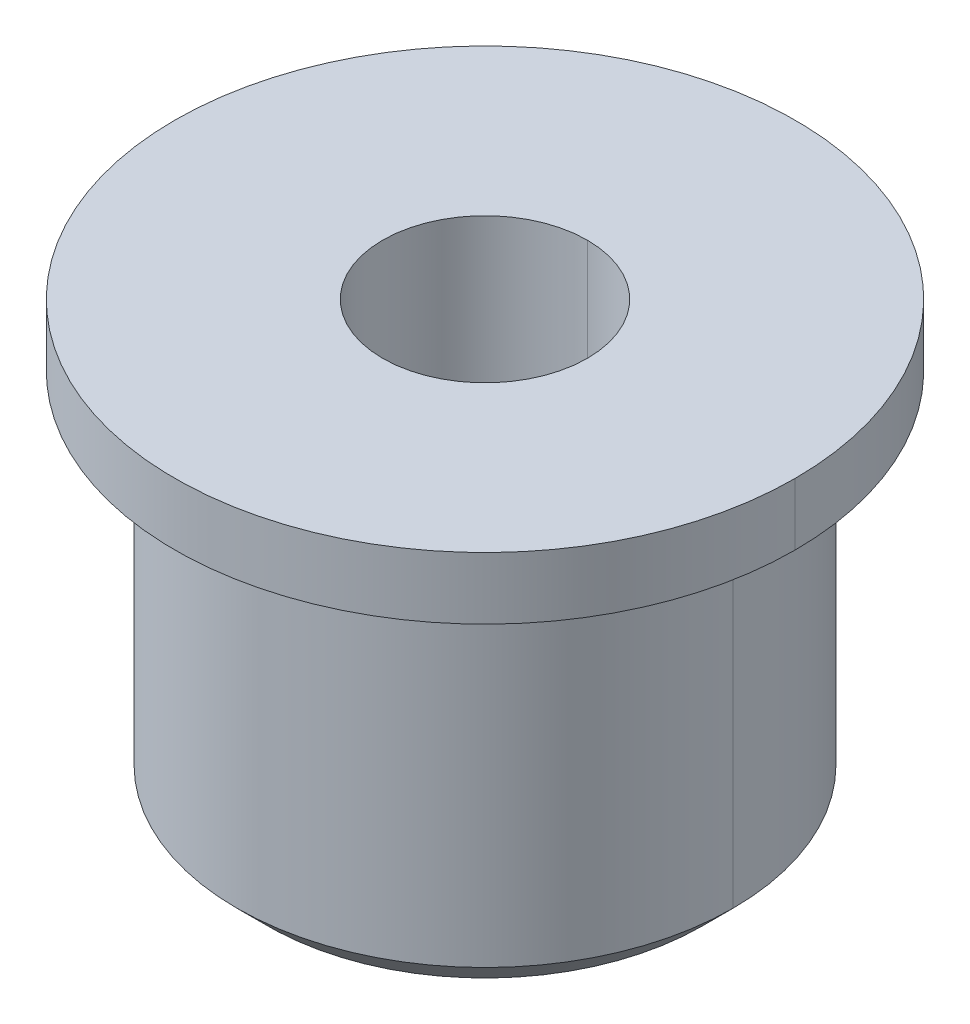
ISO-10303-21;
HEADER;
FILE_DESCRIPTION(('STEP AP214'),'2;1');
FILE_NAME('part.step','',(''),(''),'','','');
FILE_SCHEMA(('AUTOMOTIVE_DESIGN { 1 0 10303 214 1 1 1 1 }'));
ENDSEC;
DATA;
#1=APPLICATION_CONTEXT('core data for automotive mechanical design processes');
#2=APPLICATION_PROTOCOL_DEFINITION('international standard','automotive_design',2000,#1);
#3=PRODUCT_CONTEXT('',#1,'mechanical');
#4=PRODUCT('Part','Part','',(#3));
#5=PRODUCT_RELATED_PRODUCT_CATEGORY('part','',(#4));
#6=PRODUCT_DEFINITION_FORMATION('','',#4);
#7=PRODUCT_DEFINITION_CONTEXT('part definition',#1,'design');
#8=PRODUCT_DEFINITION('design','',#6,#7);
#9=PRODUCT_DEFINITION_SHAPE('','',#8);
#10=(LENGTH_UNIT() NAMED_UNIT(*) SI_UNIT(.MILLI.,.METRE.));
#11=(NAMED_UNIT(*) PLANE_ANGLE_UNIT() SI_UNIT($,.RADIAN.));
#12=(NAMED_UNIT(*) SI_UNIT($,.STERADIAN.) SOLID_ANGLE_UNIT());
#13=UNCERTAINTY_MEASURE_WITH_UNIT(LENGTH_MEASURE(1.E-05),#10,'distance_accuracy_value','');
#14=(GEOMETRIC_REPRESENTATION_CONTEXT(3) GLOBAL_UNCERTAINTY_ASSIGNED_CONTEXT((#13)) GLOBAL_UNIT_ASSIGNED_CONTEXT((#10,
#11,#12)) REPRESENTATION_CONTEXT('',''));
#15=CARTESIAN_POINT('',(0.,0.,0.));
#16=DIRECTION('',(0.,0.,1.));
#17=DIRECTION('',(1.,0.,0.));
#18=AXIS2_PLACEMENT_3D('',#15,#16,#17);
#19=CARTESIAN_POINT('',(0.,7.,0.));
#20=DIRECTION('',(0.,1.,0.));
#21=DIRECTION('',(0.,0.,1.));
#22=AXIS2_PLACEMENT_3D('',#19,#20,#21);
#23=CYLINDRICAL_SURFACE('',#22,1.65);
#24=CARTESIAN_POINT('',(0.,2.,0.));
#25=DIRECTION('',(0.,1.,0.));
#26=DIRECTION('',(0.,0.,1.));
#27=AXIS2_PLACEMENT_3D('',#24,#25,#26);
#28=CIRCLE('',#27,1.65);
#29=CARTESIAN_POINT('',(0.,2.,-1.65));
#30=VERTEX_POINT('',#29);
#31=CARTESIAN_POINT('',(0.,2.,1.65));
#32=VERTEX_POINT('',#31);
#33=EDGE_CURVE('E41',#30,#32,#28,.T.);
#34=ORIENTED_EDGE('',*,*,#33,.F.);
#35=DIRECTION('',(0.,1.,0.));
#36=VECTOR('',#35,1.);
#37=CARTESIAN_POINT('',(0.,7.,-1.65));
#38=LINE('',#37,#36);
#39=CARTESIAN_POINT('',(0.,7.,-1.65));
#40=VERTEX_POINT('',#39);
#41=EDGE_CURVE('E11',#30,#40,#38,.T.);
#42=ORIENTED_EDGE('',*,*,#41,.T.);
#43=CARTESIAN_POINT('',(0.,7.,0.));
#44=DIRECTION('',(0.,1.,0.));
#45=DIRECTION('',(0.,0.,1.));
#46=AXIS2_PLACEMENT_3D('',#43,#44,#45);
#47=CIRCLE('',#46,1.65);
#48=CARTESIAN_POINT('',(0.,7.,1.65));
#49=VERTEX_POINT('',#48);
#50=EDGE_CURVE('E27',#40,#49,#47,.T.);
#51=ORIENTED_EDGE('',*,*,#50,.T.);
#52=DIRECTION('',(0.,1.,0.));
#53=VECTOR('',#52,1.);
#54=CARTESIAN_POINT('',(0.,7.,1.65));
#55=LINE('',#54,#53);
#56=EDGE_CURVE('E79',#32,#49,#55,.T.);
#57=ORIENTED_EDGE('',*,*,#56,.F.);
#58=EDGE_LOOP('',(#34,#42,#51,#57));
#59=FACE_BOUND('',#58,.T.);
#60=ADVANCED_FACE('F16',(#59),#23,.F.);
#61=CARTESIAN_POINT('',(0.,2.,0.));
#62=DIRECTION('',(0.,1.,0.));
#63=DIRECTION('',(0.,0.,1.));
#64=AXIS2_PLACEMENT_3D('',#61,#62,#63);
#65=CONICAL_SURFACE('',#64,1.65,1.02974425867665);
#66=DIRECTION('',(0.,0.515038074910055,0.857167300702112));
#67=VECTOR('',#66,1.);
#68=CARTESIAN_POINT('',(0.,2.,1.65));
#69=LINE('',#68,#67);
#70=CARTESIAN_POINT('',(0.,1.00857997860453,0.));
#71=VERTEX_POINT('',#70);
#72=EDGE_CURVE('E142',#71,#32,#69,.T.);
#73=ORIENTED_EDGE('',*,*,#72,.F.);
#74=DIRECTION('',(0.,0.515038074910055,-0.857167300702112));
#75=VECTOR('',#74,1.);
#76=CARTESIAN_POINT('',(0.,2.,-1.65));
#77=LINE('',#76,#75);
#78=EDGE_CURVE('E145',#71,#30,#77,.T.);
#79=ORIENTED_EDGE('',*,*,#78,.T.);
#80=ORIENTED_EDGE('',*,*,#33,.T.);
#81=EDGE_LOOP('',(#73,#79,#80));
#82=FACE_BOUND('',#81,.T.);
#83=ADVANCED_FACE('F18',(#82),#65,.F.);
#84=CARTESIAN_POINT('',(0.,0.5,0.));
#85=DIRECTION('',(0.,1.,0.));
#86=DIRECTION('',(-1.,0.,0.));
#87=AXIS2_PLACEMENT_3D('',#84,#85,#86);
#88=CONICAL_SURFACE('',#87,4.,0.78539816339745);
#89=CARTESIAN_POINT('',(0.,0.,0.));
#90=DIRECTION('',(0.,-1.,0.));
#91=DIRECTION('',(1.,0.,0.));
#92=AXIS2_PLACEMENT_3D('',#89,#90,#91);
#93=CIRCLE('',#92,3.5);
#94=CARTESIAN_POINT('',(3.5,0.,0.));
#95=VERTEX_POINT('',#94);
#96=CARTESIAN_POINT('',(-3.5,0.,0.));
#97=VERTEX_POINT('',#96);
#98=EDGE_CURVE('E146',#95,#97,#93,.T.);
#99=ORIENTED_EDGE('',*,*,#98,.F.);
#100=DIRECTION('',(0.707106781186549,0.707106781186546,0.));
#101=VECTOR('',#100,1.);
#102=CARTESIAN_POINT('',(4.,0.500000000000006,0.));
#103=LINE('',#102,#101);
#104=CARTESIAN_POINT('',(4.,0.500000000000006,0.));
#105=VERTEX_POINT('',#104);
#106=EDGE_CURVE('E20',#95,#105,#103,.T.);
#107=ORIENTED_EDGE('',*,*,#106,.T.);
#108=CARTESIAN_POINT('',(0.,0.5,0.));
#109=DIRECTION('',(0.,1.,0.));
#110=DIRECTION('',(1.,0.,0.));
#111=AXIS2_PLACEMENT_3D('',#108,#109,#110);
#112=CIRCLE('',#111,4.);
#113=CARTESIAN_POINT('',(-4.,0.5,0.));
#114=VERTEX_POINT('',#113);
#115=EDGE_CURVE('E172',#114,#105,#112,.T.);
#116=ORIENTED_EDGE('',*,*,#115,.F.);
#117=DIRECTION('',(-0.707106781186549,0.707106781186546,0.));
#118=VECTOR('',#117,1.);
#119=CARTESIAN_POINT('',(-4.,0.5,0.));
#120=LINE('',#119,#118);
#121=EDGE_CURVE('E138',#97,#114,#120,.T.);
#122=ORIENTED_EDGE('',*,*,#121,.F.);
#123=EDGE_LOOP('',(#99,#107,#116,#122));
#124=FACE_BOUND('',#123,.T.);
#125=ADVANCED_FACE('F215',(#124),#88,.T.);
#126=CARTESIAN_POINT('',(0.,0.,0.));
#127=DIRECTION('',(0.,1.,0.));
#128=DIRECTION('',(-1.,0.,0.));
#129=AXIS2_PLACEMENT_3D('',#126,#127,#128);
#130=CYLINDRICAL_SURFACE('',#129,4.);
#131=ORIENTED_EDGE('',*,*,#115,.T.);
#132=DIRECTION('',(0.,1.,0.));
#133=VECTOR('',#132,1.);
#134=CARTESIAN_POINT('',(4.,0.,0.));
#135=LINE('',#134,#133);
#136=CARTESIAN_POINT('',(4.,6.,0.));
#137=VERTEX_POINT('',#136);
#138=EDGE_CURVE('E122',#105,#137,#135,.T.);
#139=ORIENTED_EDGE('',*,*,#138,.T.);
#140=CARTESIAN_POINT('',(0.,6.,0.));
#141=DIRECTION('',(0.,1.,0.));
#142=DIRECTION('',(-1.,0.,0.));
#143=AXIS2_PLACEMENT_3D('',#140,#141,#142);
#144=CIRCLE('',#143,4.);
#145=CARTESIAN_POINT('',(-4.,6.,0.));
#146=VERTEX_POINT('',#145);
#147=EDGE_CURVE('E117',#146,#137,#144,.T.);
#148=ORIENTED_EDGE('',*,*,#147,.F.);
#149=DIRECTION('',(0.,1.,0.));
#150=VECTOR('',#149,1.);
#151=CARTESIAN_POINT('',(-4.,0.,0.));
#152=LINE('',#151,#150);
#153=EDGE_CURVE('E141',#114,#146,#152,.T.);
#154=ORIENTED_EDGE('',*,*,#153,.F.);
#155=EDGE_LOOP('',(#131,#139,#148,#154));
#156=FACE_BOUND('',#155,.T.);
#157=ADVANCED_FACE('F209',(#156),#130,.T.);
#158=CARTESIAN_POINT('',(0.,0.,0.));
#159=DIRECTION('',(0.,1.,0.));
#160=DIRECTION('',(-1.,0.,0.));
#161=AXIS2_PLACEMENT_3D('',#158,#159,#160);
#162=CYLINDRICAL_SURFACE('',#161,5.);
#163=CARTESIAN_POINT('',(0.,6.,0.));
#164=DIRECTION('',(0.,1.,0.));
#165=DIRECTION('',(-1.,0.,0.));
#166=AXIS2_PLACEMENT_3D('',#163,#164,#165);
#167=CIRCLE('',#166,5.);
#168=CARTESIAN_POINT('',(-5.,6.,0.));
#169=VERTEX_POINT('',#168);
#170=CARTESIAN_POINT('',(5.,6.,0.));
#171=VERTEX_POINT('',#170);
#172=EDGE_CURVE('E108',#169,#171,#167,.T.);
#173=ORIENTED_EDGE('',*,*,#172,.T.);
#174=DIRECTION('',(0.,1.,0.));
#175=VECTOR('',#174,1.);
#176=CARTESIAN_POINT('',(5.,0.,0.));
#177=LINE('',#176,#175);
#178=CARTESIAN_POINT('',(5.,7.,0.));
#179=VERTEX_POINT('',#178);
#180=EDGE_CURVE('E123',#171,#179,#177,.T.);
#181=ORIENTED_EDGE('',*,*,#180,.T.);
#182=CARTESIAN_POINT('',(0.,7.,0.));
#183=DIRECTION('',(0.,1.,0.));
#184=DIRECTION('',(-1.,0.,0.));
#185=AXIS2_PLACEMENT_3D('',#182,#183,#184);
#186=CIRCLE('',#185,5.);
#187=CARTESIAN_POINT('',(-5.,7.,0.));
#188=VERTEX_POINT('',#187);
#189=EDGE_CURVE('E110',#188,#179,#186,.T.);
#190=ORIENTED_EDGE('',*,*,#189,.F.);
#191=DIRECTION('',(0.,1.,0.));
#192=VECTOR('',#191,1.);
#193=CARTESIAN_POINT('',(-5.,0.,0.));
#194=LINE('',#193,#192);
#195=EDGE_CURVE('E104',#169,#188,#194,.T.);
#196=ORIENTED_EDGE('',*,*,#195,.F.);
#197=EDGE_LOOP('',(#173,#181,#190,#196));
#198=FACE_BOUND('',#197,.T.);
#199=ADVANCED_FACE('F106',(#198),#162,.T.);
#200=CARTESIAN_POINT('',(-4.,0.,0.));
#201=DIRECTION('',(0.,-1.,0.));
#202=DIRECTION('',(0.,0.,-1.));
#203=AXIS2_PLACEMENT_3D('',#200,#201,#202);
#204=PLANE('',#203);
#205=CARTESIAN_POINT('',(0.,0.,0.));
#206=DIRECTION('',(0.,-1.,0.));
#207=DIRECTION('',(1.,0.,0.));
#208=AXIS2_PLACEMENT_3D('',#205,#206,#207);
#209=CIRCLE('',#208,3.5);
#210=EDGE_CURVE('E150',#97,#95,#209,.T.);
#211=ORIENTED_EDGE('',*,*,#210,.T.);
#212=ORIENTED_EDGE('',*,*,#98,.T.);
#213=EDGE_LOOP('',(#211,#212));
#214=FACE_BOUND('',#213,.T.);
#215=ADVANCED_FACE('F222',(#214),#204,.T.);
#216=CARTESIAN_POINT('',(0.,7.,0.));
#217=DIRECTION('',(0.,1.,0.));
#218=DIRECTION('',(1.,0.,0.));
#219=AXIS2_PLACEMENT_3D('',#216,#217,#218);
#220=PLANE('',#219);
#221=ORIENTED_EDGE('',*,*,#189,.T.);
#222=CARTESIAN_POINT('',(0.,7.,0.));
#223=DIRECTION('',(0.,1.,0.));
#224=DIRECTION('',(-1.,0.,0.));
#225=AXIS2_PLACEMENT_3D('',#222,#223,#224);
#226=CIRCLE('',#225,5.);
#227=EDGE_CURVE('E127',#179,#188,#226,.T.);
#228=ORIENTED_EDGE('',*,*,#227,.T.);
#229=EDGE_LOOP('',(#221,#228));
#230=FACE_BOUND('',#229,.T.);
#231=CARTESIAN_POINT('',(0.,7.,0.));
#232=DIRECTION('',(0.,1.,0.));
#233=DIRECTION('',(0.,0.,1.));
#234=AXIS2_PLACEMENT_3D('',#231,#232,#233);
#235=CIRCLE('',#234,1.65);
#236=EDGE_CURVE('E155',#49,#40,#235,.T.);
#237=ORIENTED_EDGE('',*,*,#236,.F.);
#238=ORIENTED_EDGE('',*,*,#50,.F.);
#239=EDGE_LOOP('',(#237,#238));
#240=FACE_BOUND('',#239,.T.);
#241=ADVANCED_FACE('F224',(#230,#240),#220,.T.);
#242=CARTESIAN_POINT('',(0.,0.,0.));
#243=DIRECTION('',(0.,1.,0.));
#244=DIRECTION('',(-1.,0.,0.));
#245=AXIS2_PLACEMENT_3D('',#242,#243,#244);
#246=CYLINDRICAL_SURFACE('',#245,5.);
#247=ORIENTED_EDGE('',*,*,#180,.F.);
#248=CARTESIAN_POINT('',(0.,6.,0.));
#249=DIRECTION('',(0.,1.,0.));
#250=DIRECTION('',(-1.,0.,0.));
#251=AXIS2_PLACEMENT_3D('',#248,#249,#250);
#252=CIRCLE('',#251,5.);
#253=EDGE_CURVE('E116',#171,#169,#252,.T.);
#254=ORIENTED_EDGE('',*,*,#253,.T.);
#255=ORIENTED_EDGE('',*,*,#195,.T.);
#256=ORIENTED_EDGE('',*,*,#227,.F.);
#257=EDGE_LOOP('',(#247,#254,#255,#256));
#258=FACE_BOUND('',#257,.T.);
#259=ADVANCED_FACE('F125',(#258),#246,.T.);
#260=CARTESIAN_POINT('',(-5.,6.,0.));
#261=DIRECTION('',(0.,-1.,0.));
#262=DIRECTION('',(0.,0.,-1.));
#263=AXIS2_PLACEMENT_3D('',#260,#261,#262);
#264=PLANE('',#263);
#265=ORIENTED_EDGE('',*,*,#172,.F.);
#266=ORIENTED_EDGE('',*,*,#253,.F.);
#267=EDGE_LOOP('',(#265,#266));
#268=FACE_BOUND('',#267,.T.);
#269=ORIENTED_EDGE('',*,*,#147,.T.);
#270=CARTESIAN_POINT('',(0.,6.,0.));
#271=DIRECTION('',(0.,1.,0.));
#272=DIRECTION('',(-1.,0.,0.));
#273=AXIS2_PLACEMENT_3D('',#270,#271,#272);
#274=CIRCLE('',#273,4.);
#275=EDGE_CURVE('E136',#137,#146,#274,.T.);
#276=ORIENTED_EDGE('',*,*,#275,.T.);
#277=EDGE_LOOP('',(#269,#276));
#278=FACE_BOUND('',#277,.T.);
#279=ADVANCED_FACE('F119',(#268,#278),#264,.T.);
#280=CARTESIAN_POINT('',(0.,0.,0.));
#281=DIRECTION('',(0.,1.,0.));
#282=DIRECTION('',(-1.,0.,0.));
#283=AXIS2_PLACEMENT_3D('',#280,#281,#282);
#284=CYLINDRICAL_SURFACE('',#283,4.);
#285=ORIENTED_EDGE('',*,*,#138,.F.);
#286=CARTESIAN_POINT('',(0.,0.5,0.));
#287=DIRECTION('',(0.,1.,0.));
#288=DIRECTION('',(1.,0.,0.));
#289=AXIS2_PLACEMENT_3D('',#286,#287,#288);
#290=CIRCLE('',#289,4.);
#291=EDGE_CURVE('E154',#105,#114,#290,.T.);
#292=ORIENTED_EDGE('',*,*,#291,.T.);
#293=ORIENTED_EDGE('',*,*,#153,.T.);
#294=ORIENTED_EDGE('',*,*,#275,.F.);
#295=EDGE_LOOP('',(#285,#292,#293,#294));
#296=FACE_BOUND('',#295,.T.);
#297=ADVANCED_FACE('F213',(#296),#284,.T.);
#298=CARTESIAN_POINT('',(0.,0.5,0.));
#299=DIRECTION('',(0.,1.,0.));
#300=DIRECTION('',(-1.,0.,0.));
#301=AXIS2_PLACEMENT_3D('',#298,#299,#300);
#302=CONICAL_SURFACE('',#301,4.,0.78539816339745);
#303=ORIENTED_EDGE('',*,*,#106,.F.);
#304=ORIENTED_EDGE('',*,*,#210,.F.);
#305=ORIENTED_EDGE('',*,*,#121,.T.);
#306=ORIENTED_EDGE('',*,*,#291,.F.);
#307=EDGE_LOOP('',(#303,#304,#305,#306));
#308=FACE_BOUND('',#307,.T.);
#309=ADVANCED_FACE('F220',(#308),#302,.T.);
#310=CARTESIAN_POINT('',(0.,2.,0.));
#311=DIRECTION('',(0.,1.,0.));
#312=DIRECTION('',(0.,0.,1.));
#313=AXIS2_PLACEMENT_3D('',#310,#311,#312);
#314=CONICAL_SURFACE('',#313,1.65,1.02974425867665);
#315=ORIENTED_EDGE('',*,*,#78,.F.);
#316=ORIENTED_EDGE('',*,*,#72,.T.);
#317=CARTESIAN_POINT('',(0.,2.,0.));
#318=DIRECTION('',(0.,1.,0.));
#319=DIRECTION('',(0.,0.,1.));
#320=AXIS2_PLACEMENT_3D('',#317,#318,#319);
#321=CIRCLE('',#320,1.65);
#322=EDGE_CURVE('E162',#32,#30,#321,.T.);
#323=ORIENTED_EDGE('',*,*,#322,.T.);
#324=EDGE_LOOP('',(#315,#316,#323));
#325=FACE_BOUND('',#324,.T.);
#326=ADVANCED_FACE('F252',(#325),#314,.F.);
#327=CARTESIAN_POINT('',(0.,7.,0.));
#328=DIRECTION('',(0.,1.,0.));
#329=DIRECTION('',(0.,0.,1.));
#330=AXIS2_PLACEMENT_3D('',#327,#328,#329);
#331=CYLINDRICAL_SURFACE('',#330,1.65);
#332=ORIENTED_EDGE('',*,*,#41,.F.);
#333=ORIENTED_EDGE('',*,*,#322,.F.);
#334=ORIENTED_EDGE('',*,*,#56,.T.);
#335=ORIENTED_EDGE('',*,*,#236,.T.);
#336=EDGE_LOOP('',(#332,#333,#334,#335));
#337=FACE_BOUND('',#336,.T.);
#338=ADVANCED_FACE('F244',(#337),#331,.F.);
#339=CLOSED_SHELL('',(#60,#83,#125,#157,#199,#215,#241,#259,#279,#297,#309,#326,#338));
#340=MANIFOLD_SOLID_BREP('B1',#339);
#341=ADVANCED_BREP_SHAPE_REPRESENTATION('',(#18,#340),#14);
#342=SHAPE_DEFINITION_REPRESENTATION(#9,#341);
ENDSEC;
END-ISO-10303-21;
